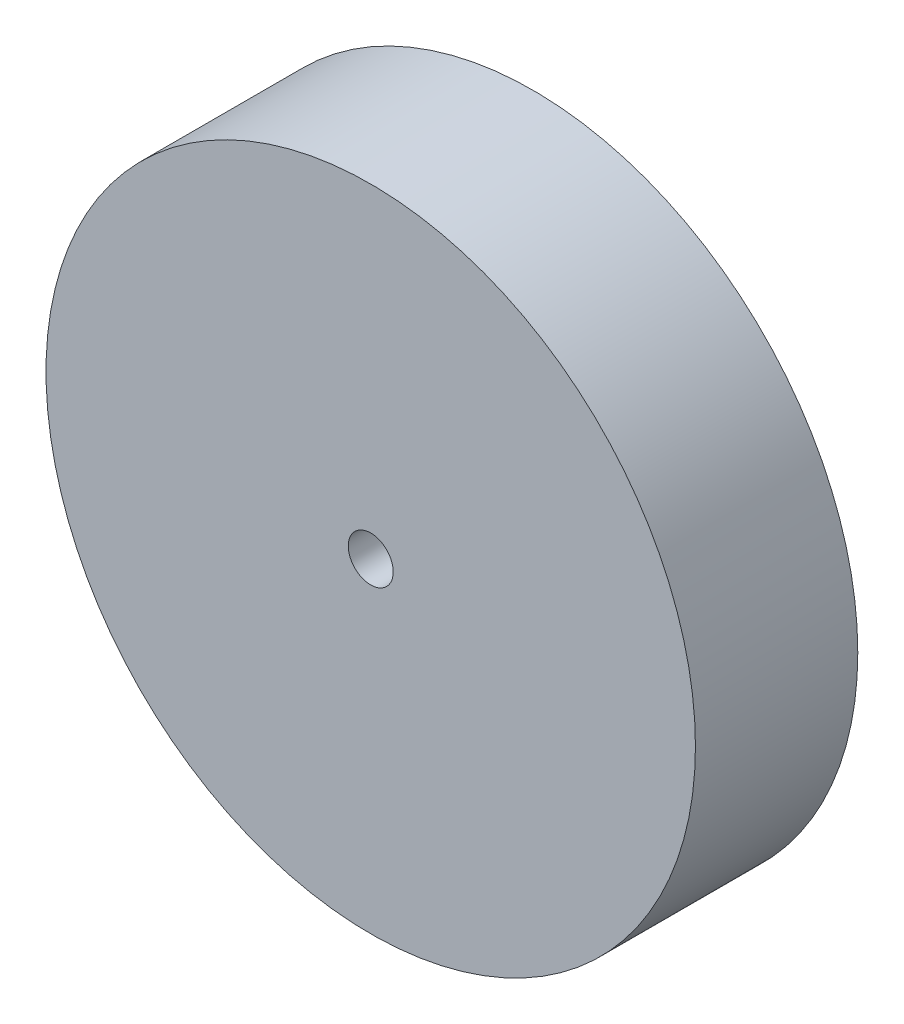
ISO-10303-21;
HEADER;
FILE_DESCRIPTION(('STEP AP214'),'2;1');
FILE_NAME('part.step','',(''),(''),'','','');
FILE_SCHEMA(('AUTOMOTIVE_DESIGN { 1 0 10303 214 1 1 1 1 }'));
ENDSEC;
DATA;
#1=APPLICATION_CONTEXT('core data for automotive mechanical design processes');
#2=APPLICATION_PROTOCOL_DEFINITION('international standard','automotive_design',2000,#1);
#3=PRODUCT_CONTEXT('',#1,'mechanical');
#4=PRODUCT('Part','Part','',(#3));
#5=PRODUCT_RELATED_PRODUCT_CATEGORY('part','',(#4));
#6=PRODUCT_DEFINITION_FORMATION('','',#4);
#7=PRODUCT_DEFINITION_CONTEXT('part definition',#1,'design');
#8=PRODUCT_DEFINITION('design','',#6,#7);
#9=PRODUCT_DEFINITION_SHAPE('','',#8);
#10=(LENGTH_UNIT() NAMED_UNIT(*) SI_UNIT(.MILLI.,.METRE.));
#11=(NAMED_UNIT(*) PLANE_ANGLE_UNIT() SI_UNIT($,.RADIAN.));
#12=(NAMED_UNIT(*) SI_UNIT($,.STERADIAN.) SOLID_ANGLE_UNIT());
#13=UNCERTAINTY_MEASURE_WITH_UNIT(LENGTH_MEASURE(1.E-05),#10,'distance_accuracy_value','');
#14=(GEOMETRIC_REPRESENTATION_CONTEXT(3) GLOBAL_UNCERTAINTY_ASSIGNED_CONTEXT((#13)) GLOBAL_UNIT_ASSIGNED_CONTEXT((#10,
#11,#12)) REPRESENTATION_CONTEXT('',''));
#15=CARTESIAN_POINT('',(0.,0.,0.));
#16=DIRECTION('',(0.,0.,1.));
#17=DIRECTION('',(1.,0.,0.));
#18=AXIS2_PLACEMENT_3D('',#15,#16,#17);
#19=CARTESIAN_POINT('',(0.,0.,5.));
#20=DIRECTION('',(0.,0.,-1.));
#21=DIRECTION('',(-1.,0.,0.));
#22=AXIS2_PLACEMENT_3D('',#19,#20,#21);
#23=CYLINDRICAL_SURFACE('',#22,10.);
#24=CARTESIAN_POINT('',(0.,0.,5.));
#25=DIRECTION('',(0.,0.,1.));
#26=DIRECTION('',(1.,0.,0.));
#27=AXIS2_PLACEMENT_3D('',#24,#25,#26);
#28=CIRCLE('',#27,10.);
#29=CARTESIAN_POINT('',(10.,0.,5.));
#30=VERTEX_POINT('',#29);
#31=EDGE_CURVE('E10',#30,#30,#28,.T.);
#32=ORIENTED_EDGE('',*,*,#31,.F.);
#33=EDGE_LOOP('',(#32));
#34=FACE_BOUND('',#33,.T.);
#35=CARTESIAN_POINT('',(0.,0.,0.));
#36=DIRECTION('',(0.,0.,1.));
#37=DIRECTION('',(1.,0.,0.));
#38=AXIS2_PLACEMENT_3D('',#35,#36,#37);
#39=CIRCLE('',#38,10.);
#40=CARTESIAN_POINT('',(10.,0.,0.));
#41=VERTEX_POINT('',#40);
#42=EDGE_CURVE('E38',#41,#41,#39,.T.);
#43=ORIENTED_EDGE('',*,*,#42,.T.);
#44=EDGE_LOOP('',(#43));
#45=FACE_BOUND('',#44,.T.);
#46=ADVANCED_FACE('F31',(#34,#45),#23,.T.);
#47=CARTESIAN_POINT('',(0.,0.,5.));
#48=DIRECTION('',(0.,0.,1.));
#49=DIRECTION('',(1.,0.,0.));
#50=AXIS2_PLACEMENT_3D('',#47,#48,#49);
#51=PLANE('',#50);
#52=CARTESIAN_POINT('',(0.,0.,5.));
#53=DIRECTION('',(0.,0.,1.));
#54=DIRECTION('',(1.,0.,0.));
#55=AXIS2_PLACEMENT_3D('',#52,#53,#54);
#56=CIRCLE('',#55,0.69285);
#57=CARTESIAN_POINT('',(0.69285,0.,5.));
#58=VERTEX_POINT('',#57);
#59=EDGE_CURVE('E44',#58,#58,#56,.T.);
#60=ORIENTED_EDGE('',*,*,#59,.F.);
#61=EDGE_LOOP('',(#60));
#62=FACE_BOUND('',#61,.T.);
#63=ORIENTED_EDGE('',*,*,#31,.T.);
#64=EDGE_LOOP('',(#63));
#65=FACE_BOUND('',#64,.T.);
#66=ADVANCED_FACE('F60',(#62,#65),#51,.T.);
#67=CARTESIAN_POINT('',(0.,0.,0.));
#68=DIRECTION('',(0.,0.,1.));
#69=DIRECTION('',(1.,0.,0.));
#70=AXIS2_PLACEMENT_3D('',#67,#68,#69);
#71=PLANE('',#70);
#72=CARTESIAN_POINT('',(0.,0.,0.));
#73=DIRECTION('',(0.,0.,1.));
#74=DIRECTION('',(1.,0.,0.));
#75=AXIS2_PLACEMENT_3D('',#72,#73,#74);
#76=CIRCLE('',#75,0.69285);
#77=CARTESIAN_POINT('',(0.69285,0.,0.));
#78=VERTEX_POINT('',#77);
#79=EDGE_CURVE('E34',#78,#78,#76,.T.);
#80=ORIENTED_EDGE('',*,*,#79,.T.);
#81=EDGE_LOOP('',(#80));
#82=FACE_BOUND('',#81,.T.);
#83=ORIENTED_EDGE('',*,*,#42,.F.);
#84=EDGE_LOOP('',(#83));
#85=FACE_BOUND('',#84,.T.);
#86=ADVANCED_FACE('F51',(#82,#85),#71,.F.);
#87=CARTESIAN_POINT('',(0.,0.,-5.));
#88=DIRECTION('',(0.,0.,1.));
#89=DIRECTION('',(1.,0.,0.));
#90=AXIS2_PLACEMENT_3D('',#87,#88,#89);
#91=CYLINDRICAL_SURFACE('',#90,0.69285);
#92=ORIENTED_EDGE('',*,*,#59,.T.);
#93=EDGE_LOOP('',(#92));
#94=FACE_BOUND('',#93,.T.);
#95=ORIENTED_EDGE('',*,*,#79,.F.);
#96=EDGE_LOOP('',(#95));
#97=FACE_BOUND('',#96,.T.);
#98=ADVANCED_FACE('F54',(#94,#97),#91,.F.);
#99=CLOSED_SHELL('',(#46,#66,#86,#98));
#100=MANIFOLD_SOLID_BREP('B2',#99);
#101=ADVANCED_BREP_SHAPE_REPRESENTATION('',(#18,#100),#14);
#102=SHAPE_DEFINITION_REPRESENTATION(#9,#101);
ENDSEC;
END-ISO-10303-21;
